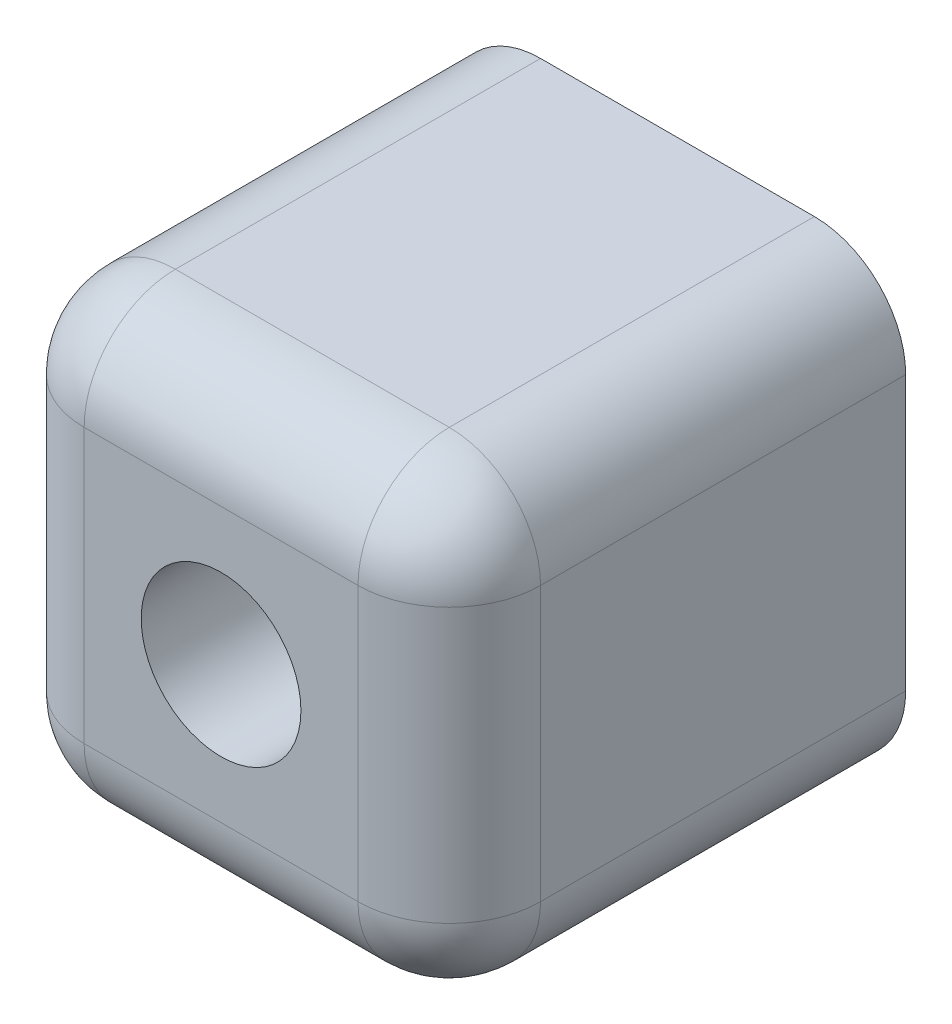
ISO-10303-21;
HEADER;
FILE_DESCRIPTION(('STEP AP214'),'2;1');
FILE_NAME('part.step','',(''),(''),'','','');
FILE_SCHEMA(('AUTOMOTIVE_DESIGN { 1 0 10303 214 1 1 1 1 }'));
ENDSEC;
DATA;
#1=APPLICATION_CONTEXT('core data for automotive mechanical design processes');
#2=APPLICATION_PROTOCOL_DEFINITION('international standard','automotive_design',2000,#1);
#3=PRODUCT_CONTEXT('',#1,'mechanical');
#4=PRODUCT('Part','Part','',(#3));
#5=PRODUCT_RELATED_PRODUCT_CATEGORY('part','',(#4));
#6=PRODUCT_DEFINITION_FORMATION('','',#4);
#7=PRODUCT_DEFINITION_CONTEXT('part definition',#1,'design');
#8=PRODUCT_DEFINITION('design','',#6,#7);
#9=PRODUCT_DEFINITION_SHAPE('','',#8);
#10=(LENGTH_UNIT() NAMED_UNIT(*) SI_UNIT(.MILLI.,.METRE.));
#11=(NAMED_UNIT(*) PLANE_ANGLE_UNIT() SI_UNIT($,.RADIAN.));
#12=(NAMED_UNIT(*) SI_UNIT($,.STERADIAN.) SOLID_ANGLE_UNIT());
#13=UNCERTAINTY_MEASURE_WITH_UNIT(LENGTH_MEASURE(1.E-05),#10,'distance_accuracy_value','');
#14=(GEOMETRIC_REPRESENTATION_CONTEXT(3) GLOBAL_UNCERTAINTY_ASSIGNED_CONTEXT((#13)) GLOBAL_UNIT_ASSIGNED_CONTEXT((#10,
#11,#12)) REPRESENTATION_CONTEXT('',''));
#15=CARTESIAN_POINT('',(0.,0.,0.));
#16=DIRECTION('',(0.,0.,1.));
#17=DIRECTION('',(1.,0.,0.));
#18=AXIS2_PLACEMENT_3D('',#15,#16,#17);
#19=CARTESIAN_POINT('',(5.,5.,0.));
#20=DIRECTION('',(0.,0.,1.));
#21=DIRECTION('',(1.,0.,0.));
#22=AXIS2_PLACEMENT_3D('',#19,#20,#21);
#23=CYLINDRICAL_SURFACE('',#22,1.75);
#24=CARTESIAN_POINT('',(5.,5.,10.));
#25=DIRECTION('',(0.,0.,1.));
#26=DIRECTION('',(1.,0.,0.));
#27=AXIS2_PLACEMENT_3D('',#24,#25,#26);
#28=CIRCLE('',#27,1.75);
#29=CARTESIAN_POINT('',(6.75,5.,10.));
#30=VERTEX_POINT('',#29);
#31=EDGE_CURVE('E152',#30,#30,#28,.T.);
#32=ORIENTED_EDGE('',*,*,#31,.T.);
#33=EDGE_LOOP('',(#32));
#34=FACE_BOUND('',#33,.T.);
#35=CARTESIAN_POINT('',(5.,5.,5.));
#36=DIRECTION('',(0.,0.,-1.));
#37=DIRECTION('',(-1.,0.,0.));
#38=AXIS2_PLACEMENT_3D('',#35,#36,#37);
#39=CIRCLE('',#38,1.75);
#40=CARTESIAN_POINT('',(3.25,5.,5.));
#41=VERTEX_POINT('',#40);
#42=EDGE_CURVE('E150',#41,#41,#39,.F.);
#43=ORIENTED_EDGE('',*,*,#42,.F.);
#44=EDGE_LOOP('',(#43));
#45=FACE_BOUND('',#44,.T.);
#46=ADVANCED_FACE('F37',(#34,#45),#23,.F.);
#47=CARTESIAN_POINT('',(0.,0.,10.));
#48=DIRECTION('',(1.,0.,0.));
#49=DIRECTION('',(0.,0.,-1.));
#50=AXIS2_PLACEMENT_3D('',#47,#48,#49);
#51=PLANE('',#50);
#52=DIRECTION('',(0.,0.,-1.));
#53=VECTOR('',#52,1.);
#54=CARTESIAN_POINT('',(0.,2.,10.));
#55=LINE('',#54,#53);
#56=CARTESIAN_POINT('',(0.,2.,0.));
#57=VERTEX_POINT('',#56);
#58=CARTESIAN_POINT('',(0.,2.,8.));
#59=VERTEX_POINT('',#58);
#60=EDGE_CURVE('E161',#57,#59,#55,.F.);
#61=ORIENTED_EDGE('',*,*,#60,.T.);
#62=DIRECTION('',(0.,-1.,0.));
#63=VECTOR('',#62,1.);
#64=CARTESIAN_POINT('',(0.,0.,8.));
#65=LINE('',#64,#63);
#66=CARTESIAN_POINT('',(0.,8.,8.));
#67=VERTEX_POINT('',#66);
#68=EDGE_CURVE('E182',#59,#67,#65,.F.);
#69=ORIENTED_EDGE('',*,*,#68,.T.);
#70=DIRECTION('',(0.,0.,-1.));
#71=VECTOR('',#70,1.);
#72=CARTESIAN_POINT('',(0.,8.,10.));
#73=LINE('',#72,#71);
#74=CARTESIAN_POINT('',(0.,8.,0.));
#75=VERTEX_POINT('',#74);
#76=EDGE_CURVE('E164',#67,#75,#73,.T.);
#77=ORIENTED_EDGE('',*,*,#76,.T.);
#78=DIRECTION('',(0.,-1.,0.));
#79=VECTOR('',#78,1.);
#80=CARTESIAN_POINT('',(0.,0.,0.));
#81=LINE('',#80,#79);
#82=EDGE_CURVE('E225',#75,#57,#81,.T.);
#83=ORIENTED_EDGE('',*,*,#82,.T.);
#84=EDGE_LOOP('',(#61,#69,#77,#83));
#85=FACE_BOUND('',#84,.T.);
#86=ADVANCED_FACE('F261',(#85),#51,.F.);
#87=CARTESIAN_POINT('',(0.,0.,10.));
#88=DIRECTION('',(0.,1.,0.));
#89=DIRECTION('',(0.,0.,1.));
#90=AXIS2_PLACEMENT_3D('',#87,#88,#89);
#91=PLANE('',#90);
#92=DIRECTION('',(0.,0.,-1.));
#93=VECTOR('',#92,1.);
#94=CARTESIAN_POINT('',(8.,0.,10.));
#95=LINE('',#94,#93);
#96=CARTESIAN_POINT('',(8.,0.,0.));
#97=VERTEX_POINT('',#96);
#98=CARTESIAN_POINT('',(8.,0.,8.));
#99=VERTEX_POINT('',#98);
#100=EDGE_CURVE('E166',#97,#99,#95,.F.);
#101=ORIENTED_EDGE('',*,*,#100,.T.);
#102=DIRECTION('',(1.,0.,0.));
#103=VECTOR('',#102,1.);
#104=CARTESIAN_POINT('',(0.,0.,8.));
#105=LINE('',#104,#103);
#106=CARTESIAN_POINT('',(2.,0.,8.));
#107=VERTEX_POINT('',#106);
#108=EDGE_CURVE('E11',#99,#107,#105,.F.);
#109=ORIENTED_EDGE('',*,*,#108,.T.);
#110=DIRECTION('',(0.,0.,-1.));
#111=VECTOR('',#110,1.);
#112=CARTESIAN_POINT('',(2.,0.,10.));
#113=LINE('',#112,#111);
#114=CARTESIAN_POINT('',(2.,0.,0.));
#115=VERTEX_POINT('',#114);
#116=EDGE_CURVE('E168',#107,#115,#113,.T.);
#117=ORIENTED_EDGE('',*,*,#116,.T.);
#118=DIRECTION('',(1.,0.,0.));
#119=VECTOR('',#118,1.);
#120=CARTESIAN_POINT('',(0.,0.,0.));
#121=LINE('',#120,#119);
#122=EDGE_CURVE('E146',#115,#97,#121,.T.);
#123=ORIENTED_EDGE('',*,*,#122,.T.);
#124=EDGE_LOOP('',(#101,#109,#117,#123));
#125=FACE_BOUND('',#124,.T.);
#126=ADVANCED_FACE('F230',(#125),#91,.F.);
#127=CARTESIAN_POINT('',(10.,0.,10.));
#128=DIRECTION('',(-1.,0.,0.));
#129=DIRECTION('',(0.,0.,1.));
#130=AXIS2_PLACEMENT_3D('',#127,#128,#129);
#131=PLANE('',#130);
#132=DIRECTION('',(0.,0.,-1.));
#133=VECTOR('',#132,1.);
#134=CARTESIAN_POINT('',(10.,8.,10.));
#135=LINE('',#134,#133);
#136=CARTESIAN_POINT('',(10.,8.,0.));
#137=VERTEX_POINT('',#136);
#138=CARTESIAN_POINT('',(10.,8.,8.));
#139=VERTEX_POINT('',#138);
#140=EDGE_CURVE('E133',#137,#139,#135,.F.);
#141=ORIENTED_EDGE('',*,*,#140,.T.);
#142=DIRECTION('',(0.,1.,0.));
#143=VECTOR('',#142,1.);
#144=CARTESIAN_POINT('',(10.,0.,8.));
#145=LINE('',#144,#143);
#146=CARTESIAN_POINT('',(10.,2.,8.));
#147=VERTEX_POINT('',#146);
#148=EDGE_CURVE('E61',#139,#147,#145,.F.);
#149=ORIENTED_EDGE('',*,*,#148,.T.);
#150=DIRECTION('',(0.,0.,-1.));
#151=VECTOR('',#150,1.);
#152=CARTESIAN_POINT('',(10.,2.,10.));
#153=LINE('',#152,#151);
#154=CARTESIAN_POINT('',(10.,2.,0.));
#155=VERTEX_POINT('',#154);
#156=EDGE_CURVE('E137',#147,#155,#153,.T.);
#157=ORIENTED_EDGE('',*,*,#156,.T.);
#158=DIRECTION('',(0.,1.,0.));
#159=VECTOR('',#158,1.);
#160=CARTESIAN_POINT('',(10.,0.,0.));
#161=LINE('',#160,#159);
#162=EDGE_CURVE('E143',#155,#137,#161,.T.);
#163=ORIENTED_EDGE('',*,*,#162,.T.);
#164=EDGE_LOOP('',(#141,#149,#157,#163));
#165=FACE_BOUND('',#164,.T.);
#166=ADVANCED_FACE('F237',(#165),#131,.F.);
#167=CARTESIAN_POINT('',(0.,10.,10.));
#168=DIRECTION('',(0.,-1.,0.));
#169=DIRECTION('',(0.,0.,-1.));
#170=AXIS2_PLACEMENT_3D('',#167,#168,#169);
#171=PLANE('',#170);
#172=DIRECTION('',(0.,0.,-1.));
#173=VECTOR('',#172,1.);
#174=CARTESIAN_POINT('',(2.,10.,10.));
#175=LINE('',#174,#173);
#176=CARTESIAN_POINT('',(2.,10.,0.));
#177=VERTEX_POINT('',#176);
#178=CARTESIAN_POINT('',(2.,10.,8.));
#179=VERTEX_POINT('',#178);
#180=EDGE_CURVE('E128',#177,#179,#175,.F.);
#181=ORIENTED_EDGE('',*,*,#180,.T.);
#182=DIRECTION('',(-1.,0.,0.));
#183=VECTOR('',#182,1.);
#184=CARTESIAN_POINT('',(0.,10.,8.));
#185=LINE('',#184,#183);
#186=CARTESIAN_POINT('',(8.,10.,8.));
#187=VERTEX_POINT('',#186);
#188=EDGE_CURVE('E124',#179,#187,#185,.F.);
#189=ORIENTED_EDGE('',*,*,#188,.T.);
#190=DIRECTION('',(0.,0.,-1.));
#191=VECTOR('',#190,1.);
#192=CARTESIAN_POINT('',(8.,10.,10.));
#193=LINE('',#192,#191);
#194=CARTESIAN_POINT('',(8.,10.,0.));
#195=VERTEX_POINT('',#194);
#196=EDGE_CURVE('E116',#187,#195,#193,.T.);
#197=ORIENTED_EDGE('',*,*,#196,.T.);
#198=DIRECTION('',(-1.,0.,0.));
#199=VECTOR('',#198,1.);
#200=CARTESIAN_POINT('',(0.,10.,0.));
#201=LINE('',#200,#199);
#202=EDGE_CURVE('E121',#195,#177,#201,.T.);
#203=ORIENTED_EDGE('',*,*,#202,.T.);
#204=EDGE_LOOP('',(#181,#189,#197,#203));
#205=FACE_BOUND('',#204,.T.);
#206=ADVANCED_FACE('F119',(#205),#171,.F.);
#207=CARTESIAN_POINT('',(0.,0.,10.));
#208=DIRECTION('',(0.,0.,-1.));
#209=DIRECTION('',(-1.,0.,0.));
#210=AXIS2_PLACEMENT_3D('',#207,#208,#209);
#211=PLANE('',#210);
#212=DIRECTION('',(-1.,0.,0.));
#213=VECTOR('',#212,1.);
#214=CARTESIAN_POINT('',(0.,8.,10.));
#215=LINE('',#214,#213);
#216=CARTESIAN_POINT('',(8.,8.,10.));
#217=VERTEX_POINT('',#216);
#218=CARTESIAN_POINT('',(2.,8.,10.));
#219=VERTEX_POINT('',#218);
#220=EDGE_CURVE('E177',#217,#219,#215,.T.);
#221=ORIENTED_EDGE('',*,*,#220,.T.);
#222=DIRECTION('',(0.,-1.,0.));
#223=VECTOR('',#222,1.);
#224=CARTESIAN_POINT('',(2.,0.,10.));
#225=LINE('',#224,#223);
#226=CARTESIAN_POINT('',(2.,2.,10.));
#227=VERTEX_POINT('',#226);
#228=EDGE_CURVE('E179',#219,#227,#225,.T.);
#229=ORIENTED_EDGE('',*,*,#228,.T.);
#230=DIRECTION('',(1.,0.,0.));
#231=VECTOR('',#230,1.);
#232=CARTESIAN_POINT('',(0.,2.,10.));
#233=LINE('',#232,#231);
#234=CARTESIAN_POINT('',(8.,2.,10.));
#235=VERTEX_POINT('',#234);
#236=EDGE_CURVE('E173',#227,#235,#233,.T.);
#237=ORIENTED_EDGE('',*,*,#236,.T.);
#238=DIRECTION('',(0.,1.,0.));
#239=VECTOR('',#238,1.);
#240=CARTESIAN_POINT('',(8.,0.,10.));
#241=LINE('',#240,#239);
#242=EDGE_CURVE('E175',#235,#217,#241,.T.);
#243=ORIENTED_EDGE('',*,*,#242,.T.);
#244=EDGE_LOOP('',(#221,#229,#237,#243));
#245=FACE_BOUND('',#244,.T.);
#246=ORIENTED_EDGE('',*,*,#31,.F.);
#247=EDGE_LOOP('',(#246));
#248=FACE_BOUND('',#247,.T.);
#249=ADVANCED_FACE('F270',(#245,#248),#211,.F.);
#250=CARTESIAN_POINT('',(0.,0.,0.));
#251=DIRECTION('',(0.,0.,-1.));
#252=DIRECTION('',(-1.,0.,0.));
#253=AXIS2_PLACEMENT_3D('',#250,#251,#252);
#254=PLANE('',#253);
#255=CARTESIAN_POINT('',(5.,5.,0.));
#256=DIRECTION('',(0.,0.,-1.));
#257=DIRECTION('',(-1.,0.,0.));
#258=AXIS2_PLACEMENT_3D('',#255,#256,#257);
#259=CIRCLE('',#258,2.304);
#260=CARTESIAN_POINT('',(2.696,5.,0.));
#261=VERTEX_POINT('',#260);
#262=EDGE_CURVE('E213',#261,#261,#259,.T.);
#263=ORIENTED_EDGE('',*,*,#262,.F.);
#264=EDGE_LOOP('',(#263));
#265=FACE_BOUND('',#264,.T.);
#266=ORIENTED_EDGE('',*,*,#202,.F.);
#267=CARTESIAN_POINT('',(8.,8.,0.));
#268=DIRECTION('',(0.,0.,-1.));
#269=DIRECTION('',(-1.,0.,0.));
#270=AXIS2_PLACEMENT_3D('',#267,#268,#269);
#271=CIRCLE('',#270,2.);
#272=EDGE_CURVE('E131',#195,#137,#271,.T.);
#273=ORIENTED_EDGE('',*,*,#272,.T.);
#274=ORIENTED_EDGE('',*,*,#162,.F.);
#275=CARTESIAN_POINT('',(8.,2.,0.));
#276=DIRECTION('',(0.,0.,-1.));
#277=DIRECTION('',(-1.,0.,0.));
#278=AXIS2_PLACEMENT_3D('',#275,#276,#277);
#279=CIRCLE('',#278,2.);
#280=EDGE_CURVE('E127',#155,#97,#279,.T.);
#281=ORIENTED_EDGE('',*,*,#280,.T.);
#282=ORIENTED_EDGE('',*,*,#122,.F.);
#283=CARTESIAN_POINT('',(2.,2.,0.));
#284=DIRECTION('',(0.,0.,-1.));
#285=DIRECTION('',(-1.,0.,0.));
#286=AXIS2_PLACEMENT_3D('',#283,#284,#285);
#287=CIRCLE('',#286,2.);
#288=EDGE_CURVE('E156',#115,#57,#287,.T.);
#289=ORIENTED_EDGE('',*,*,#288,.T.);
#290=ORIENTED_EDGE('',*,*,#82,.F.);
#291=CARTESIAN_POINT('',(2.,8.,0.));
#292=DIRECTION('',(0.,0.,-1.));
#293=DIRECTION('',(-1.,0.,0.));
#294=AXIS2_PLACEMENT_3D('',#291,#292,#293);
#295=CIRCLE('',#294,2.);
#296=EDGE_CURVE('E138',#75,#177,#295,.T.);
#297=ORIENTED_EDGE('',*,*,#296,.T.);
#298=EDGE_LOOP('',(#266,#273,#274,#281,#282,#289,#290,#297));
#299=FACE_BOUND('',#298,.T.);
#300=ADVANCED_FACE('F140',(#265,#299),#254,.T.);
#301=CARTESIAN_POINT('',(5.,5.,5.));
#302=DIRECTION('',(0.,0.,-1.));
#303=DIRECTION('',(-1.,0.,0.));
#304=AXIS2_PLACEMENT_3D('',#301,#302,#303);
#305=PLANE('',#304);
#306=CARTESIAN_POINT('',(5.,5.,5.));
#307=DIRECTION('',(0.,0.,-1.));
#308=DIRECTION('',(-1.,0.,0.));
#309=AXIS2_PLACEMENT_3D('',#306,#307,#308);
#310=CIRCLE('',#309,2.304);
#311=CARTESIAN_POINT('',(2.696,5.,5.));
#312=VERTEX_POINT('',#311);
#313=EDGE_CURVE('E153',#312,#312,#310,.T.);
#314=ORIENTED_EDGE('',*,*,#313,.T.);
#315=EDGE_LOOP('',(#314));
#316=FACE_BOUND('',#315,.T.);
#317=ORIENTED_EDGE('',*,*,#42,.T.);
#318=EDGE_LOOP('',(#317));
#319=FACE_BOUND('',#318,.T.);
#320=ADVANCED_FACE('F281',(#316,#319),#305,.T.);
#321=CARTESIAN_POINT('',(5.,5.,5.));
#322=DIRECTION('',(0.,0.,-1.));
#323=DIRECTION('',(-1.,0.,0.));
#324=AXIS2_PLACEMENT_3D('',#321,#322,#323);
#325=CYLINDRICAL_SURFACE('',#324,2.304);
#326=ORIENTED_EDGE('',*,*,#313,.F.);
#327=EDGE_LOOP('',(#326));
#328=FACE_BOUND('',#327,.T.);
#329=ORIENTED_EDGE('',*,*,#262,.T.);
#330=EDGE_LOOP('',(#329));
#331=FACE_BOUND('',#330,.T.);
#332=ADVANCED_FACE('F283',(#328,#331),#325,.F.);
#333=CARTESIAN_POINT('',(8.,8.,10.));
#334=DIRECTION('',(0.,0.,-1.));
#335=DIRECTION('',(-1.,0.,0.));
#336=AXIS2_PLACEMENT_3D('',#333,#334,#335);
#337=CYLINDRICAL_SURFACE('',#336,2.);
#338=ORIENTED_EDGE('',*,*,#196,.F.);
#339=CARTESIAN_POINT('',(8.,8.,8.));
#340=DIRECTION('',(0.,0.,-1.));
#341=DIRECTION('',(-1.,0.,0.));
#342=AXIS2_PLACEMENT_3D('',#339,#340,#341);
#343=CIRCLE('',#342,2.);
#344=EDGE_CURVE('E187',#187,#139,#343,.T.);
#345=ORIENTED_EDGE('',*,*,#344,.T.);
#346=ORIENTED_EDGE('',*,*,#140,.F.);
#347=ORIENTED_EDGE('',*,*,#272,.F.);
#348=EDGE_LOOP('',(#338,#345,#346,#347));
#349=FACE_BOUND('',#348,.T.);
#350=ADVANCED_FACE('F132',(#349),#337,.T.);
#351=CARTESIAN_POINT('',(2.,8.,10.));
#352=DIRECTION('',(0.,0.,-1.));
#353=DIRECTION('',(-1.,0.,0.));
#354=AXIS2_PLACEMENT_3D('',#351,#352,#353);
#355=CYLINDRICAL_SURFACE('',#354,2.);
#356=ORIENTED_EDGE('',*,*,#76,.F.);
#357=CARTESIAN_POINT('',(2.,8.,8.));
#358=DIRECTION('',(0.,0.,-1.));
#359=DIRECTION('',(-1.,0.,0.));
#360=AXIS2_PLACEMENT_3D('',#357,#358,#359);
#361=CIRCLE('',#360,2.);
#362=EDGE_CURVE('E184',#67,#179,#361,.T.);
#363=ORIENTED_EDGE('',*,*,#362,.T.);
#364=ORIENTED_EDGE('',*,*,#180,.F.);
#365=ORIENTED_EDGE('',*,*,#296,.F.);
#366=EDGE_LOOP('',(#356,#363,#364,#365));
#367=FACE_BOUND('',#366,.T.);
#368=ADVANCED_FACE('F264',(#367),#355,.T.);
#369=CARTESIAN_POINT('',(2.,2.,10.));
#370=DIRECTION('',(0.,0.,-1.));
#371=DIRECTION('',(-1.,0.,0.));
#372=AXIS2_PLACEMENT_3D('',#369,#370,#371);
#373=CYLINDRICAL_SURFACE('',#372,2.);
#374=ORIENTED_EDGE('',*,*,#116,.F.);
#375=CARTESIAN_POINT('',(2.,2.,8.));
#376=DIRECTION('',(0.,0.,-1.));
#377=DIRECTION('',(-1.,0.,0.));
#378=AXIS2_PLACEMENT_3D('',#375,#376,#377);
#379=CIRCLE('',#378,2.);
#380=EDGE_CURVE('E170',#107,#59,#379,.T.);
#381=ORIENTED_EDGE('',*,*,#380,.T.);
#382=ORIENTED_EDGE('',*,*,#60,.F.);
#383=ORIENTED_EDGE('',*,*,#288,.F.);
#384=EDGE_LOOP('',(#374,#381,#382,#383));
#385=FACE_BOUND('',#384,.T.);
#386=ADVANCED_FACE('F249',(#385),#373,.T.);
#387=CARTESIAN_POINT('',(8.,2.,10.));
#388=DIRECTION('',(0.,0.,-1.));
#389=DIRECTION('',(-1.,0.,0.));
#390=AXIS2_PLACEMENT_3D('',#387,#388,#389);
#391=CYLINDRICAL_SURFACE('',#390,2.);
#392=ORIENTED_EDGE('',*,*,#156,.F.);
#393=CARTESIAN_POINT('',(8.,2.,8.));
#394=DIRECTION('',(0.,0.,-1.));
#395=DIRECTION('',(-1.,0.,0.));
#396=AXIS2_PLACEMENT_3D('',#393,#394,#395);
#397=CIRCLE('',#396,2.);
#398=EDGE_CURVE('E46',#147,#99,#397,.T.);
#399=ORIENTED_EDGE('',*,*,#398,.T.);
#400=ORIENTED_EDGE('',*,*,#100,.F.);
#401=ORIENTED_EDGE('',*,*,#280,.F.);
#402=EDGE_LOOP('',(#392,#399,#400,#401));
#403=FACE_BOUND('',#402,.T.);
#404=ADVANCED_FACE('F235',(#403),#391,.T.);
#405=CARTESIAN_POINT('',(8.,8.,8.));
#406=DIRECTION('',(0.,0.,1.));
#407=DIRECTION('',(1.,0.,0.));
#408=AXIS2_PLACEMENT_3D('',#405,#406,#407);
#409=SPHERICAL_SURFACE('',#408,2.);
#410=CARTESIAN_POINT('',(8.,8.,8.));
#411=DIRECTION('',(0.,-1.,0.));
#412=DIRECTION('',(0.,0.,-1.));
#413=AXIS2_PLACEMENT_3D('',#410,#411,#412);
#414=CIRCLE('',#413,2.);
#415=EDGE_CURVE('E206',#139,#217,#414,.T.);
#416=ORIENTED_EDGE('',*,*,#415,.F.);
#417=ORIENTED_EDGE('',*,*,#344,.F.);
#418=CARTESIAN_POINT('',(8.,8.,8.));
#419=DIRECTION('',(-1.,0.,0.));
#420=DIRECTION('',(0.,0.,1.));
#421=AXIS2_PLACEMENT_3D('',#418,#419,#420);
#422=CIRCLE('',#421,2.);
#423=EDGE_CURVE('E41',#217,#187,#422,.T.);
#424=ORIENTED_EDGE('',*,*,#423,.F.);
#425=EDGE_LOOP('',(#416,#417,#424));
#426=FACE_BOUND('',#425,.T.);
#427=ADVANCED_FACE('F39',(#426),#409,.T.);
#428=CARTESIAN_POINT('',(0.,8.,8.));
#429=DIRECTION('',(-1.,0.,0.));
#430=DIRECTION('',(0.,0.,1.));
#431=AXIS2_PLACEMENT_3D('',#428,#429,#430);
#432=CYLINDRICAL_SURFACE('',#431,2.);
#433=ORIENTED_EDGE('',*,*,#423,.T.);
#434=ORIENTED_EDGE('',*,*,#188,.F.);
#435=CARTESIAN_POINT('',(2.,8.,8.));
#436=DIRECTION('',(-1.,0.,0.));
#437=DIRECTION('',(0.,0.,1.));
#438=AXIS2_PLACEMENT_3D('',#435,#436,#437);
#439=CIRCLE('',#438,2.);
#440=EDGE_CURVE('E204',#219,#179,#439,.T.);
#441=ORIENTED_EDGE('',*,*,#440,.F.);
#442=ORIENTED_EDGE('',*,*,#220,.F.);
#443=EDGE_LOOP('',(#433,#434,#441,#442));
#444=FACE_BOUND('',#443,.T.);
#445=ADVANCED_FACE('F268',(#444),#432,.T.);
#446=CARTESIAN_POINT('',(8.,0.,8.));
#447=DIRECTION('',(0.,1.,0.));
#448=DIRECTION('',(0.,0.,1.));
#449=AXIS2_PLACEMENT_3D('',#446,#447,#448);
#450=CYLINDRICAL_SURFACE('',#449,2.);
#451=ORIENTED_EDGE('',*,*,#415,.T.);
#452=ORIENTED_EDGE('',*,*,#242,.F.);
#453=CARTESIAN_POINT('',(8.,2.,8.));
#454=DIRECTION('',(0.,-1.,0.));
#455=DIRECTION('',(0.,0.,-1.));
#456=AXIS2_PLACEMENT_3D('',#453,#454,#455);
#457=CIRCLE('',#456,2.);
#458=EDGE_CURVE('E201',#147,#235,#457,.T.);
#459=ORIENTED_EDGE('',*,*,#458,.F.);
#460=ORIENTED_EDGE('',*,*,#148,.F.);
#461=EDGE_LOOP('',(#451,#452,#459,#460));
#462=FACE_BOUND('',#461,.T.);
#463=ADVANCED_FACE('F239',(#462),#450,.T.);
#464=CARTESIAN_POINT('',(2.,8.,8.));
#465=DIRECTION('',(0.,0.,1.));
#466=DIRECTION('',(1.,0.,0.));
#467=AXIS2_PLACEMENT_3D('',#464,#465,#466);
#468=SPHERICAL_SURFACE('',#467,2.);
#469=ORIENTED_EDGE('',*,*,#440,.T.);
#470=ORIENTED_EDGE('',*,*,#362,.F.);
#471=CARTESIAN_POINT('',(2.,8.,8.));
#472=DIRECTION('',(0.,-1.,0.));
#473=DIRECTION('',(0.,0.,-1.));
#474=AXIS2_PLACEMENT_3D('',#471,#472,#473);
#475=CIRCLE('',#474,2.);
#476=EDGE_CURVE('E198',#219,#67,#475,.T.);
#477=ORIENTED_EDGE('',*,*,#476,.F.);
#478=EDGE_LOOP('',(#469,#470,#477));
#479=FACE_BOUND('',#478,.T.);
#480=ADVANCED_FACE('F266',(#479),#468,.T.);
#481=CARTESIAN_POINT('',(8.,2.,8.));
#482=DIRECTION('',(0.,0.,1.));
#483=DIRECTION('',(1.,0.,0.));
#484=AXIS2_PLACEMENT_3D('',#481,#482,#483);
#485=SPHERICAL_SURFACE('',#484,2.);
#486=ORIENTED_EDGE('',*,*,#398,.F.);
#487=ORIENTED_EDGE('',*,*,#458,.T.);
#488=CARTESIAN_POINT('',(8.,2.,8.));
#489=DIRECTION('',(-1.,0.,0.));
#490=DIRECTION('',(0.,0.,1.));
#491=AXIS2_PLACEMENT_3D('',#488,#489,#490);
#492=CIRCLE('',#491,2.);
#493=EDGE_CURVE('E195',#99,#235,#492,.T.);
#494=ORIENTED_EDGE('',*,*,#493,.F.);
#495=EDGE_LOOP('',(#486,#487,#494));
#496=FACE_BOUND('',#495,.T.);
#497=ADVANCED_FACE('F241',(#496),#485,.T.);
#498=CARTESIAN_POINT('',(2.,0.,8.));
#499=DIRECTION('',(0.,-1.,0.));
#500=DIRECTION('',(0.,0.,-1.));
#501=AXIS2_PLACEMENT_3D('',#498,#499,#500);
#502=CYLINDRICAL_SURFACE('',#501,2.);
#503=ORIENTED_EDGE('',*,*,#476,.T.);
#504=ORIENTED_EDGE('',*,*,#68,.F.);
#505=CARTESIAN_POINT('',(2.,2.,8.));
#506=DIRECTION('',(0.,-1.,0.));
#507=DIRECTION('',(0.,0.,-1.));
#508=AXIS2_PLACEMENT_3D('',#505,#506,#507);
#509=CIRCLE('',#508,2.);
#510=EDGE_CURVE('E193',#227,#59,#509,.T.);
#511=ORIENTED_EDGE('',*,*,#510,.F.);
#512=ORIENTED_EDGE('',*,*,#228,.F.);
#513=EDGE_LOOP('',(#503,#504,#511,#512));
#514=FACE_BOUND('',#513,.T.);
#515=ADVANCED_FACE('F257',(#514),#502,.T.);
#516=CARTESIAN_POINT('',(0.,2.,8.));
#517=DIRECTION('',(1.,0.,0.));
#518=DIRECTION('',(0.,0.,-1.));
#519=AXIS2_PLACEMENT_3D('',#516,#517,#518);
#520=CYLINDRICAL_SURFACE('',#519,2.);
#521=ORIENTED_EDGE('',*,*,#493,.T.);
#522=ORIENTED_EDGE('',*,*,#236,.F.);
#523=CARTESIAN_POINT('',(2.,2.,8.));
#524=DIRECTION('',(-1.,0.,0.));
#525=DIRECTION('',(0.,0.,1.));
#526=AXIS2_PLACEMENT_3D('',#523,#524,#525);
#527=CIRCLE('',#526,2.);
#528=EDGE_CURVE('E191',#107,#227,#527,.T.);
#529=ORIENTED_EDGE('',*,*,#528,.F.);
#530=ORIENTED_EDGE('',*,*,#108,.F.);
#531=EDGE_LOOP('',(#521,#522,#529,#530));
#532=FACE_BOUND('',#531,.T.);
#533=ADVANCED_FACE('F246',(#532),#520,.T.);
#534=CARTESIAN_POINT('',(2.,2.,8.));
#535=DIRECTION('',(0.,0.,1.));
#536=DIRECTION('',(1.,0.,0.));
#537=AXIS2_PLACEMENT_3D('',#534,#535,#536);
#538=SPHERICAL_SURFACE('',#537,2.);
#539=ORIENTED_EDGE('',*,*,#510,.T.);
#540=ORIENTED_EDGE('',*,*,#380,.F.);
#541=ORIENTED_EDGE('',*,*,#528,.T.);
#542=EDGE_LOOP('',(#539,#540,#541));
#543=FACE_BOUND('',#542,.T.);
#544=ADVANCED_FACE('F252',(#543),#538,.T.);
#545=CLOSED_SHELL('',(#46,#86,#126,#166,#206,#249,#300,#320,#332,#350,#368,#386,#404,#427,#445,
#463,#480,#497,#515,#533,#544));
#546=MANIFOLD_SOLID_BREP('B2',#545);
#547=ADVANCED_BREP_SHAPE_REPRESENTATION('',(#18,#546),#14);
#548=SHAPE_DEFINITION_REPRESENTATION(#9,#547);
ENDSEC;
END-ISO-10303-21;
